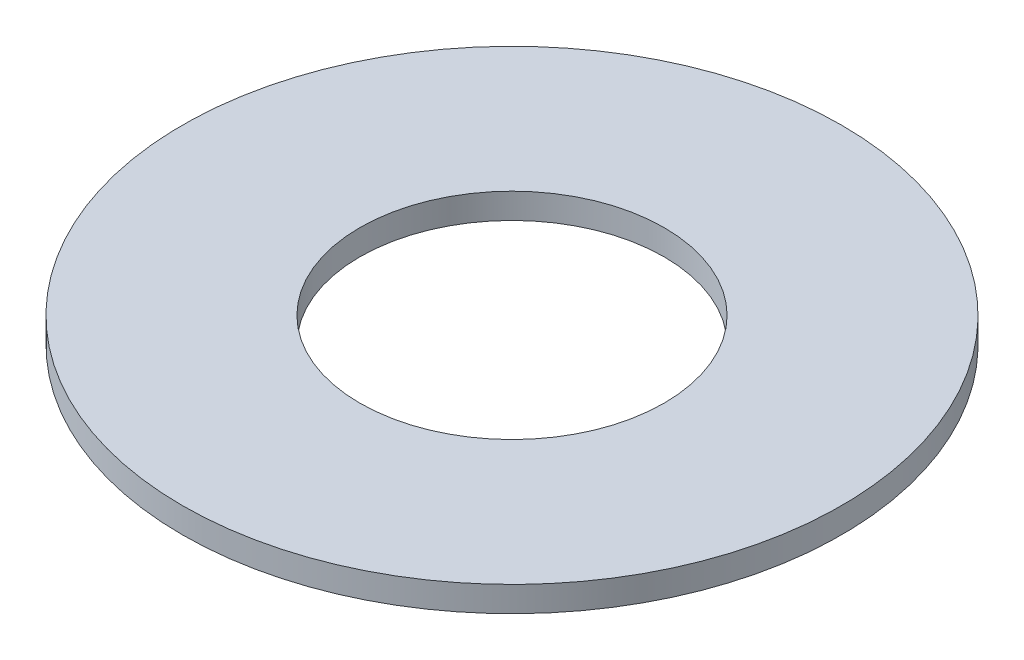
ISO-10303-21;
HEADER;
FILE_DESCRIPTION(('STEP AP214'),'2;1');
FILE_NAME('part.step','',(''),(''),'','','');
FILE_SCHEMA(('AUTOMOTIVE_DESIGN { 1 0 10303 214 1 1 1 1 }'));
ENDSEC;
DATA;
#1=APPLICATION_CONTEXT('core data for automotive mechanical design processes');
#2=APPLICATION_PROTOCOL_DEFINITION('international standard','automotive_design',2000,#1);
#3=PRODUCT_CONTEXT('',#1,'mechanical');
#4=PRODUCT('Part','Part','',(#3));
#5=PRODUCT_RELATED_PRODUCT_CATEGORY('part','',(#4));
#6=PRODUCT_DEFINITION_FORMATION('','',#4);
#7=PRODUCT_DEFINITION_CONTEXT('part definition',#1,'design');
#8=PRODUCT_DEFINITION('design','',#6,#7);
#9=PRODUCT_DEFINITION_SHAPE('','',#8);
#10=(LENGTH_UNIT() NAMED_UNIT(*) SI_UNIT(.MILLI.,.METRE.));
#11=(NAMED_UNIT(*) PLANE_ANGLE_UNIT() SI_UNIT($,.RADIAN.));
#12=(NAMED_UNIT(*) SI_UNIT($,.STERADIAN.) SOLID_ANGLE_UNIT());
#13=UNCERTAINTY_MEASURE_WITH_UNIT(LENGTH_MEASURE(1.E-05),#10,'distance_accuracy_value','');
#14=(GEOMETRIC_REPRESENTATION_CONTEXT(3) GLOBAL_UNCERTAINTY_ASSIGNED_CONTEXT((#13)) GLOBAL_UNIT_ASSIGNED_CONTEXT((#10,
#11,#12)) REPRESENTATION_CONTEXT('',''));
#15=CARTESIAN_POINT('',(0.,0.,0.));
#16=DIRECTION('',(0.,0.,1.));
#17=DIRECTION('',(1.,0.,0.));
#18=AXIS2_PLACEMENT_3D('',#15,#16,#17);
#19=CARTESIAN_POINT('',(0.,0.,0.));
#20=DIRECTION('',(0.,1.,0.));
#21=DIRECTION('',(0.,0.,1.));
#22=AXIS2_PLACEMENT_3D('',#19,#20,#21);
#23=CYLINDRICAL_SURFACE('',#22,6.);
#24=CARTESIAN_POINT('',(0.,1.,0.));
#25=DIRECTION('',(0.,1.,0.));
#26=DIRECTION('',(0.,0.,1.));
#27=AXIS2_PLACEMENT_3D('',#24,#25,#26);
#28=CIRCLE('',#27,6.);
#29=CARTESIAN_POINT('',(0.,1.,6.));
#30=VERTEX_POINT('',#29);
#31=EDGE_CURVE('E10',#30,#30,#28,.T.);
#32=ORIENTED_EDGE('',*,*,#31,.T.);
#33=EDGE_LOOP('',(#32));
#34=FACE_BOUND('',#33,.T.);
#35=CARTESIAN_POINT('',(0.,0.,0.));
#36=DIRECTION('',(0.,1.,0.));
#37=DIRECTION('',(0.,0.,1.));
#38=AXIS2_PLACEMENT_3D('',#35,#36,#37);
#39=CIRCLE('',#38,6.);
#40=CARTESIAN_POINT('',(0.,0.,6.));
#41=VERTEX_POINT('',#40);
#42=EDGE_CURVE('E45',#41,#41,#39,.T.);
#43=ORIENTED_EDGE('',*,*,#42,.F.);
#44=EDGE_LOOP('',(#43));
#45=FACE_BOUND('',#44,.T.);
#46=ADVANCED_FACE('F31',(#34,#45),#23,.F.);
#47=CARTESIAN_POINT('',(6.,1.,0.));
#48=DIRECTION('',(0.,1.,0.));
#49=DIRECTION('',(0.,0.,1.));
#50=AXIS2_PLACEMENT_3D('',#47,#48,#49);
#51=PLANE('',#50);
#52=CARTESIAN_POINT('',(0.,1.,0.));
#53=DIRECTION('',(0.,1.,0.));
#54=DIRECTION('',(0.,0.,1.));
#55=AXIS2_PLACEMENT_3D('',#52,#53,#54);
#56=CIRCLE('',#55,13.);
#57=CARTESIAN_POINT('',(0.,1.,13.));
#58=VERTEX_POINT('',#57);
#59=EDGE_CURVE('E37',#58,#58,#56,.T.);
#60=ORIENTED_EDGE('',*,*,#59,.T.);
#61=EDGE_LOOP('',(#60));
#62=FACE_BOUND('',#61,.T.);
#63=ORIENTED_EDGE('',*,*,#31,.F.);
#64=EDGE_LOOP('',(#63));
#65=FACE_BOUND('',#64,.T.);
#66=ADVANCED_FACE('F55',(#62,#65),#51,.T.);
#67=CARTESIAN_POINT('',(0.,0.,0.));
#68=DIRECTION('',(0.,1.,0.));
#69=DIRECTION('',(0.,0.,1.));
#70=AXIS2_PLACEMENT_3D('',#67,#68,#69);
#71=CYLINDRICAL_SURFACE('',#70,13.);
#72=CARTESIAN_POINT('',(0.,0.,0.));
#73=DIRECTION('',(0.,1.,0.));
#74=DIRECTION('',(0.,0.,1.));
#75=AXIS2_PLACEMENT_3D('',#72,#73,#74);
#76=CIRCLE('',#75,13.);
#77=CARTESIAN_POINT('',(0.,0.,13.));
#78=VERTEX_POINT('',#77);
#79=EDGE_CURVE('E41',#78,#78,#76,.T.);
#80=ORIENTED_EDGE('',*,*,#79,.T.);
#81=EDGE_LOOP('',(#80));
#82=FACE_BOUND('',#81,.T.);
#83=ORIENTED_EDGE('',*,*,#59,.F.);
#84=EDGE_LOOP('',(#83));
#85=FACE_BOUND('',#84,.T.);
#86=ADVANCED_FACE('F59',(#82,#85),#71,.T.);
#87=CARTESIAN_POINT('',(13.,0.,0.));
#88=DIRECTION('',(0.,-1.,0.));
#89=DIRECTION('',(0.,0.,-1.));
#90=AXIS2_PLACEMENT_3D('',#87,#88,#89);
#91=PLANE('',#90);
#92=ORIENTED_EDGE('',*,*,#42,.T.);
#93=EDGE_LOOP('',(#92));
#94=FACE_BOUND('',#93,.T.);
#95=ORIENTED_EDGE('',*,*,#79,.F.);
#96=EDGE_LOOP('',(#95));
#97=FACE_BOUND('',#96,.T.);
#98=ADVANCED_FACE('F51',(#94,#97),#91,.T.);
#99=CLOSED_SHELL('',(#46,#66,#86,#98));
#100=MANIFOLD_SOLID_BREP('B2',#99);
#101=ADVANCED_BREP_SHAPE_REPRESENTATION('',(#18,#100),#14);
#102=SHAPE_DEFINITION_REPRESENTATION(#9,#101);
ENDSEC;
END-ISO-10303-21;
